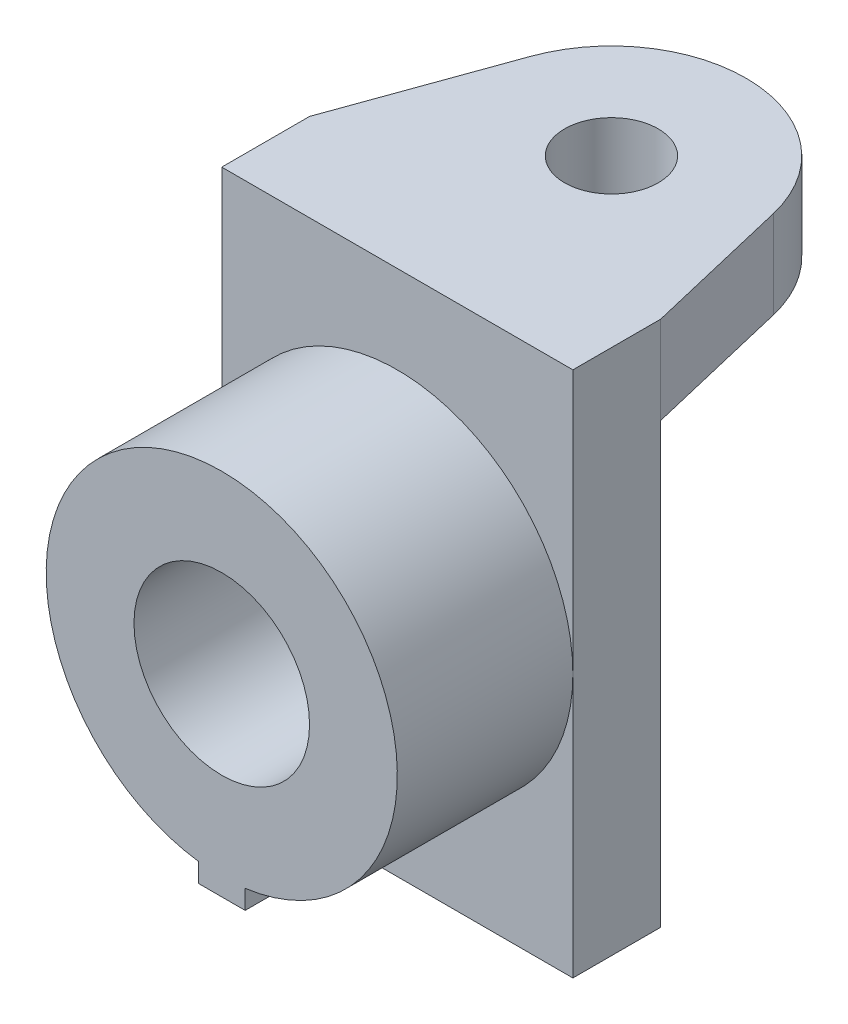
ISO-10303-21;
HEADER;
FILE_DESCRIPTION(('STEP AP214'),'2;1');
FILE_NAME('part.step','',(''),(''),'','','');
FILE_SCHEMA(('AUTOMOTIVE_DESIGN { 1 0 10303 214 1 1 1 1 }'));
ENDSEC;
DATA;
#1=APPLICATION_CONTEXT('core data for automotive mechanical design processes');
#2=APPLICATION_PROTOCOL_DEFINITION('international standard','automotive_design',2000,#1);
#3=PRODUCT_CONTEXT('',#1,'mechanical');
#4=PRODUCT('Part','Part','',(#3));
#5=PRODUCT_RELATED_PRODUCT_CATEGORY('part','',(#4));
#6=PRODUCT_DEFINITION_FORMATION('','',#4);
#7=PRODUCT_DEFINITION_CONTEXT('part definition',#1,'design');
#8=PRODUCT_DEFINITION('design','',#6,#7);
#9=PRODUCT_DEFINITION_SHAPE('','',#8);
#10=(LENGTH_UNIT() NAMED_UNIT(*) SI_UNIT(.MILLI.,.METRE.));
#11=(NAMED_UNIT(*) PLANE_ANGLE_UNIT() SI_UNIT($,.RADIAN.));
#12=(NAMED_UNIT(*) SI_UNIT($,.STERADIAN.) SOLID_ANGLE_UNIT());
#13=UNCERTAINTY_MEASURE_WITH_UNIT(LENGTH_MEASURE(1.E-05),#10,'distance_accuracy_value','');
#14=(GEOMETRIC_REPRESENTATION_CONTEXT(3) GLOBAL_UNCERTAINTY_ASSIGNED_CONTEXT((#13)) GLOBAL_UNIT_ASSIGNED_CONTEXT((#10,
#11,#12)) REPRESENTATION_CONTEXT('',''));
#15=CARTESIAN_POINT('',(0.,0.,0.));
#16=DIRECTION('',(0.,0.,1.));
#17=DIRECTION('',(1.,0.,0.));
#18=AXIS2_PLACEMENT_3D('',#15,#16,#17);
#19=CARTESIAN_POINT('',(0.,0.,0.));
#20=DIRECTION('',(0.,0.,1.));
#21=DIRECTION('',(1.,0.,0.));
#22=AXIS2_PLACEMENT_3D('',#19,#20,#21);
#23=PLANE('',#22);
#24=DIRECTION('',(-1.,0.,0.));
#25=VECTOR('',#24,1.);
#26=CARTESIAN_POINT('',(-7.13576707726763,10.5308398656215,0.));
#27=LINE('',#26,#25);
#28=CARTESIAN_POINT('',(22.8642329227324,10.5308398656215,0.));
#29=VERTEX_POINT('',#28);
#30=CARTESIAN_POINT('',(-37.1357670772676,10.5308398656215,0.));
#31=VERTEX_POINT('',#30);
#32=EDGE_CURVE('E91',#29,#31,#27,.T.);
#33=ORIENTED_EDGE('',*,*,#32,.F.);
#34=DIRECTION('',(0.,1.,0.));
#35=VECTOR('',#34,1.);
#36=CARTESIAN_POINT('',(22.8642329227324,25.5308398656215,0.));
#37=LINE('',#36,#35);
#38=CARTESIAN_POINT('',(22.8642329227324,-64.4691601343785,0.));
#39=VERTEX_POINT('',#38);
#40=EDGE_CURVE('E288',#39,#29,#37,.T.);
#41=ORIENTED_EDGE('',*,*,#40,.F.);
#42=DIRECTION('',(1.,0.,0.));
#43=VECTOR('',#42,1.);
#44=CARTESIAN_POINT('',(-37.1357670772676,-64.4691601343785,0.));
#45=LINE('',#44,#43);
#46=CARTESIAN_POINT('',(-37.1357670772676,-64.4691601343785,0.));
#47=VERTEX_POINT('',#46);
#48=EDGE_CURVE('E285',#47,#39,#45,.T.);
#49=ORIENTED_EDGE('',*,*,#48,.F.);
#50=DIRECTION('',(0.,-1.,0.));
#51=VECTOR('',#50,1.);
#52=CARTESIAN_POINT('',(-37.1357670772676,25.5308398656215,0.));
#53=LINE('',#52,#51);
#54=EDGE_CURVE('E254',#31,#47,#53,.T.);
#55=ORIENTED_EDGE('',*,*,#54,.F.);
#56=EDGE_LOOP('',(#33,#41,#49,#55));
#57=FACE_BOUND('',#56,.T.);
#58=ADVANCED_FACE('F72',(#57),#23,.F.);
#59=CARTESIAN_POINT('',(0.,0.,15.));
#60=DIRECTION('',(0.,0.,1.));
#61=DIRECTION('',(1.,0.,0.));
#62=AXIS2_PLACEMENT_3D('',#59,#60,#61);
#63=PLANE('',#62);
#64=CARTESIAN_POINT('',(-7.13576707726763,-19.4691601343785,15.));
#65=DIRECTION('',(0.,0.,1.));
#66=DIRECTION('',(1.,0.,0.));
#67=AXIS2_PLACEMENT_3D('',#64,#65,#66);
#68=CIRCLE('',#67,30.);
#69=CARTESIAN_POINT('',(-3.13576707726761,-49.2012976290155,15.));
#70=VERTEX_POINT('',#69);
#71=CARTESIAN_POINT('',(22.8642329227324,-19.4691601343785,15.));
#72=VERTEX_POINT('',#71);
#73=EDGE_CURVE('E84',#70,#72,#68,.T.);
#74=ORIENTED_EDGE('',*,*,#73,.F.);
#75=DIRECTION('',(0.,-1.,0.));
#76=VECTOR('',#75,1.);
#77=CARTESIAN_POINT('',(-3.13576707726761,-49.2012976290155,15.));
#78=LINE('',#77,#76);
#79=CARTESIAN_POINT('',(-3.13576707726761,-52.4691601343785,15.));
#80=VERTEX_POINT('',#79);
#81=EDGE_CURVE('E99',#70,#80,#78,.T.);
#82=ORIENTED_EDGE('',*,*,#81,.T.);
#83=DIRECTION('',(1.,0.,0.));
#84=VECTOR('',#83,1.);
#85=CARTESIAN_POINT('',(-11.1357670772676,-52.4691601343785,15.));
#86=LINE('',#85,#84);
#87=CARTESIAN_POINT('',(-11.1357670772676,-52.4691601343785,15.));
#88=VERTEX_POINT('',#87);
#89=EDGE_CURVE('E240',#88,#80,#86,.T.);
#90=ORIENTED_EDGE('',*,*,#89,.F.);
#91=DIRECTION('',(0.,-1.,0.));
#92=VECTOR('',#91,1.);
#93=CARTESIAN_POINT('',(-11.1357670772676,-49.2012976290156,15.));
#94=LINE('',#93,#92);
#95=CARTESIAN_POINT('',(-11.1357670772677,-49.2012976290155,15.));
#96=VERTEX_POINT('',#95);
#97=EDGE_CURVE('E244',#96,#88,#94,.T.);
#98=ORIENTED_EDGE('',*,*,#97,.F.);
#99=CARTESIAN_POINT('',(-37.1357670772676,-19.4691601343785,15.));
#100=VERTEX_POINT('',#99);
#101=EDGE_CURVE('E82',#100,#96,#68,.T.);
#102=ORIENTED_EDGE('',*,*,#101,.F.);
#103=DIRECTION('',(0.,-1.,0.));
#104=VECTOR('',#103,1.);
#105=CARTESIAN_POINT('',(-37.1357670772676,25.5308398656215,15.));
#106=LINE('',#105,#104);
#107=CARTESIAN_POINT('',(-37.1357670772676,-64.4691601343785,15.));
#108=VERTEX_POINT('',#107);
#109=EDGE_CURVE('E270',#100,#108,#106,.T.);
#110=ORIENTED_EDGE('',*,*,#109,.T.);
#111=DIRECTION('',(1.,0.,0.));
#112=VECTOR('',#111,1.);
#113=CARTESIAN_POINT('',(-37.1357670772676,-64.4691601343785,15.));
#114=LINE('',#113,#112);
#115=CARTESIAN_POINT('',(22.8642329227324,-64.4691601343785,15.));
#116=VERTEX_POINT('',#115);
#117=EDGE_CURVE('E269',#108,#116,#114,.T.);
#118=ORIENTED_EDGE('',*,*,#117,.T.);
#119=DIRECTION('',(0.,1.,0.));
#120=VECTOR('',#119,1.);
#121=CARTESIAN_POINT('',(22.8642329227324,25.5308398656215,15.));
#122=LINE('',#121,#120);
#123=EDGE_CURVE('E274',#116,#72,#122,.T.);
#124=ORIENTED_EDGE('',*,*,#123,.T.);
#125=EDGE_LOOP('',(#74,#82,#90,#98,#102,#110,#118,#124));
#126=FACE_BOUND('',#125,.T.);
#127=ADVANCED_FACE('F328',(#126),#63,.T.);
#128=CARTESIAN_POINT('',(-37.1357670772676,25.5308398656215,15.));
#129=DIRECTION('',(1.,0.,0.));
#130=DIRECTION('',(0.,1.,0.));
#131=AXIS2_PLACEMENT_3D('',#128,#129,#130);
#132=PLANE('',#131);
#133=CARTESIAN_POINT('',(-37.1357670772676,25.5308398656215,0.));
#134=VERTEX_POINT('',#133);
#135=EDGE_CURVE('E282',#134,#31,#53,.T.);
#136=ORIENTED_EDGE('',*,*,#135,.T.);
#137=ORIENTED_EDGE('',*,*,#54,.T.);
#138=DIRECTION('',(0.,0.,-1.));
#139=VECTOR('',#138,1.);
#140=CARTESIAN_POINT('',(-37.1357670772676,-64.4691601343785,15.));
#141=LINE('',#140,#139);
#142=EDGE_CURVE('E76',#108,#47,#141,.T.);
#143=ORIENTED_EDGE('',*,*,#142,.F.);
#144=ORIENTED_EDGE('',*,*,#109,.F.);
#145=CARTESIAN_POINT('',(-37.1357670772676,25.5308398656215,15.));
#146=VERTEX_POINT('',#145);
#147=EDGE_CURVE('E265',#146,#100,#106,.T.);
#148=ORIENTED_EDGE('',*,*,#147,.F.);
#149=DIRECTION('',(0.,0.,-1.));
#150=VECTOR('',#149,1.);
#151=CARTESIAN_POINT('',(-37.1357670772676,25.5308398656215,15.));
#152=LINE('',#151,#150);
#153=EDGE_CURVE('E281',#146,#134,#152,.T.);
#154=ORIENTED_EDGE('',*,*,#153,.T.);
#155=EDGE_LOOP('',(#136,#137,#143,#144,#148,#154));
#156=FACE_BOUND('',#155,.T.);
#157=ADVANCED_FACE('F74',(#156),#132,.F.);
#158=CARTESIAN_POINT('',(-37.1357670772676,-64.4691601343785,15.));
#159=DIRECTION('',(0.,1.,0.));
#160=DIRECTION('',(0.,0.,1.));
#161=AXIS2_PLACEMENT_3D('',#158,#159,#160);
#162=PLANE('',#161);
#163=ORIENTED_EDGE('',*,*,#48,.T.);
#164=DIRECTION('',(0.,0.,-1.));
#165=VECTOR('',#164,1.);
#166=CARTESIAN_POINT('',(22.8642329227324,-64.4691601343785,15.));
#167=LINE('',#166,#165);
#168=EDGE_CURVE('E296',#116,#39,#167,.T.);
#169=ORIENTED_EDGE('',*,*,#168,.F.);
#170=ORIENTED_EDGE('',*,*,#117,.F.);
#171=ORIENTED_EDGE('',*,*,#142,.T.);
#172=EDGE_LOOP('',(#163,#169,#170,#171));
#173=FACE_BOUND('',#172,.T.);
#174=ADVANCED_FACE('F337',(#173),#162,.F.);
#175=CARTESIAN_POINT('',(22.8642329227324,25.5308398656215,15.));
#176=DIRECTION('',(-1.,0.,0.));
#177=DIRECTION('',(0.,-1.,0.));
#178=AXIS2_PLACEMENT_3D('',#175,#176,#177);
#179=PLANE('',#178);
#180=ORIENTED_EDGE('',*,*,#40,.T.);
#181=DIRECTION('',(0.,1.,0.));
#182=VECTOR('',#181,1.);
#183=CARTESIAN_POINT('',(22.8642329227324,10.5308398656215,0.));
#184=LINE('',#183,#182);
#185=CARTESIAN_POINT('',(22.8642329227324,25.5308398656215,0.));
#186=VERTEX_POINT('',#185);
#187=EDGE_CURVE('E191',#29,#186,#184,.T.);
#188=ORIENTED_EDGE('',*,*,#187,.T.);
#189=DIRECTION('',(0.,0.,-1.));
#190=VECTOR('',#189,1.);
#191=CARTESIAN_POINT('',(22.8642329227324,25.5308398656215,15.));
#192=LINE('',#191,#190);
#193=CARTESIAN_POINT('',(22.8642329227324,25.5308398656215,15.));
#194=VERTEX_POINT('',#193);
#195=EDGE_CURVE('E293',#194,#186,#192,.T.);
#196=ORIENTED_EDGE('',*,*,#195,.F.);
#197=EDGE_CURVE('E273',#72,#194,#122,.T.);
#198=ORIENTED_EDGE('',*,*,#197,.F.);
#199=ORIENTED_EDGE('',*,*,#123,.F.);
#200=ORIENTED_EDGE('',*,*,#168,.T.);
#201=EDGE_LOOP('',(#180,#188,#196,#198,#199,#200));
#202=FACE_BOUND('',#201,.T.);
#203=ADVANCED_FACE('F352',(#202),#179,.F.);
#204=CARTESIAN_POINT('',(-37.1357670772676,25.5308398656215,15.));
#205=DIRECTION('',(0.,-1.,0.));
#206=DIRECTION('',(0.,0.,-1.));
#207=AXIS2_PLACEMENT_3D('',#204,#205,#206);
#208=PLANE('',#207);
#209=ORIENTED_EDGE('',*,*,#195,.T.);
#210=DIRECTION('',(-0.230824264676834,0.,-0.972995456739855));
#211=VECTOR('',#210,1.);
#212=CARTESIAN_POINT('',(22.8642329227324,25.5308398656215,0.));
#213=LINE('',#212,#211);
#214=CARTESIAN_POINT('',(16.8691395042144,25.5308398656215,-25.2711675140209));
#215=VERTEX_POINT('',#214);
#216=EDGE_CURVE('E206',#186,#215,#213,.T.);
#217=ORIENTED_EDGE('',*,*,#216,.T.);
#218=CARTESIAN_POINT('',(-5.50975600080225,25.5308398656215,-19.9622094264538));
#219=DIRECTION('',(0.,1.,0.));
#220=DIRECTION('',(0.,0.,1.));
#221=AXIS2_PLACEMENT_3D('',#218,#219,#220);
#222=CIRCLE('',#221,23.);
#223=CARTESIAN_POINT('',(-27.1515062685642,25.5308398656215,-27.7490345399276));
#224=VERTEX_POINT('',#223);
#225=EDGE_CURVE('E172',#215,#224,#222,.T.);
#226=ORIENTED_EDGE('',*,*,#225,.T.);
#227=DIRECTION('',(0.338557613629299,0.,-0.940945663815735));
#228=VECTOR('',#227,1.);
#229=CARTESIAN_POINT('',(-37.1357670772676,25.5308398656215,0.));
#230=LINE('',#229,#228);
#231=EDGE_CURVE('E193',#134,#224,#230,.T.);
#232=ORIENTED_EDGE('',*,*,#231,.F.);
#233=ORIENTED_EDGE('',*,*,#153,.F.);
#234=DIRECTION('',(-1.,0.,0.));
#235=VECTOR('',#234,1.);
#236=CARTESIAN_POINT('',(-37.1357670772676,25.5308398656215,15.));
#237=LINE('',#236,#235);
#238=EDGE_CURVE('E278',#194,#146,#237,.T.);
#239=ORIENTED_EDGE('',*,*,#238,.F.);
#240=EDGE_LOOP('',(#209,#217,#226,#232,#233,#239));
#241=FACE_BOUND('',#240,.T.);
#242=CARTESIAN_POINT('',(-5.50975600080225,25.5308398656215,-19.9622094264538));
#243=DIRECTION('',(0.,1.,0.));
#244=DIRECTION('',(0.,0.,1.));
#245=AXIS2_PLACEMENT_3D('',#242,#243,#244);
#246=CIRCLE('',#245,8.);
#247=CARTESIAN_POINT('',(-5.50975600080225,25.5308398656215,-11.9622094264538));
#248=VERTEX_POINT('',#247);
#249=EDGE_CURVE('E199',#248,#248,#246,.T.);
#250=ORIENTED_EDGE('',*,*,#249,.F.);
#251=EDGE_LOOP('',(#250));
#252=FACE_BOUND('',#251,.T.);
#253=ADVANCED_FACE('F345',(#241,#252),#208,.F.);
#254=EDGE_CURVE('E12',#72,#100,#68,.T.);
#255=ORIENTED_EDGE('',*,*,#254,.F.);
#256=ORIENTED_EDGE('',*,*,#197,.T.);
#257=ORIENTED_EDGE('',*,*,#238,.T.);
#258=ORIENTED_EDGE('',*,*,#147,.T.);
#259=EDGE_LOOP('',(#255,#256,#257,#258));
#260=FACE_BOUND('',#259,.T.);
#261=ADVANCED_FACE('F332',(#260),#63,.T.);
#262=CARTESIAN_POINT('',(-7.13576707726763,-19.4691601343785,45.));
#263=DIRECTION('',(0.,0.,1.));
#264=DIRECTION('',(1.,0.,0.));
#265=AXIS2_PLACEMENT_3D('',#262,#263,#264);
#266=PLANE('',#265);
#267=DIRECTION('',(0.,-1.,0.));
#268=VECTOR('',#267,1.);
#269=CARTESIAN_POINT('',(-3.13576707726761,-49.2012976290155,45.));
#270=LINE('',#269,#268);
#271=CARTESIAN_POINT('',(-3.13576707726761,-49.2012976290155,45.));
#272=VERTEX_POINT('',#271);
#273=CARTESIAN_POINT('',(-3.13576707726761,-52.4691601343785,45.));
#274=VERTEX_POINT('',#273);
#275=EDGE_CURVE('E224',#272,#274,#270,.T.);
#276=ORIENTED_EDGE('',*,*,#275,.F.);
#277=CARTESIAN_POINT('',(-7.13576707726763,-19.4691601343785,45.));
#278=DIRECTION('',(0.,0.,1.));
#279=DIRECTION('',(1.,0.,0.));
#280=AXIS2_PLACEMENT_3D('',#277,#278,#279);
#281=CIRCLE('',#280,30.);
#282=CARTESIAN_POINT('',(-11.1357670772677,-49.2012976290155,45.));
#283=VERTEX_POINT('',#282);
#284=EDGE_CURVE('E234',#272,#283,#281,.T.);
#285=ORIENTED_EDGE('',*,*,#284,.T.);
#286=DIRECTION('',(0.,-1.,0.));
#287=VECTOR('',#286,1.);
#288=CARTESIAN_POINT('',(-11.1357670772676,-49.2012976290156,45.));
#289=LINE('',#288,#287);
#290=CARTESIAN_POINT('',(-11.1357670772676,-52.4691601343785,45.));
#291=VERTEX_POINT('',#290);
#292=EDGE_CURVE('E231',#283,#291,#289,.T.);
#293=ORIENTED_EDGE('',*,*,#292,.T.);
#294=DIRECTION('',(1.,0.,0.));
#295=VECTOR('',#294,1.);
#296=CARTESIAN_POINT('',(-11.1357670772676,-52.4691601343785,45.));
#297=LINE('',#296,#295);
#298=EDGE_CURVE('E228',#291,#274,#297,.T.);
#299=ORIENTED_EDGE('',*,*,#298,.T.);
#300=EDGE_LOOP('',(#276,#285,#293,#299));
#301=FACE_BOUND('',#300,.T.);
#302=CARTESIAN_POINT('',(-7.13576707726763,-19.4691601343785,45.));
#303=DIRECTION('',(0.,0.,1.));
#304=DIRECTION('',(1.,0.,0.));
#305=AXIS2_PLACEMENT_3D('',#302,#303,#304);
#306=CIRCLE('',#305,15.);
#307=CARTESIAN_POINT('',(7.86423292273237,-19.4691601343785,45.));
#308=VERTEX_POINT('',#307);
#309=EDGE_CURVE('E217',#308,#308,#306,.T.);
#310=ORIENTED_EDGE('',*,*,#309,.F.);
#311=EDGE_LOOP('',(#310));
#312=FACE_BOUND('',#311,.T.);
#313=ADVANCED_FACE('F321',(#301,#312),#266,.T.);
#314=CARTESIAN_POINT('',(-3.13576707726761,-49.2012976290155,45.));
#315=DIRECTION('',(1.,0.,0.));
#316=DIRECTION('',(0.,1.,0.));
#317=AXIS2_PLACEMENT_3D('',#314,#315,#316);
#318=PLANE('',#317);
#319=ORIENTED_EDGE('',*,*,#81,.F.);
#320=DIRECTION('',(0.,0.,-1.));
#321=VECTOR('',#320,1.);
#322=CARTESIAN_POINT('',(-3.13576707726761,-49.2012976290155,45.));
#323=LINE('',#322,#321);
#324=EDGE_CURVE('E250',#272,#70,#323,.T.);
#325=ORIENTED_EDGE('',*,*,#324,.F.);
#326=ORIENTED_EDGE('',*,*,#275,.T.);
#327=DIRECTION('',(0.,0.,-1.));
#328=VECTOR('',#327,1.);
#329=CARTESIAN_POINT('',(-3.13576707726761,-52.4691601343785,45.));
#330=LINE('',#329,#328);
#331=EDGE_CURVE('E237',#274,#80,#330,.T.);
#332=ORIENTED_EDGE('',*,*,#331,.T.);
#333=EDGE_LOOP('',(#319,#325,#326,#332));
#334=FACE_BOUND('',#333,.T.);
#335=ADVANCED_FACE('F325',(#334),#318,.T.);
#336=CARTESIAN_POINT('',(-7.13576707726763,-19.4691601343785,45.));
#337=DIRECTION('',(0.,0.,-1.));
#338=DIRECTION('',(-1.,0.,0.));
#339=AXIS2_PLACEMENT_3D('',#336,#337,#338);
#340=CYLINDRICAL_SURFACE('',#339,30.);
#341=ORIENTED_EDGE('',*,*,#73,.T.);
#342=ORIENTED_EDGE('',*,*,#254,.T.);
#343=ORIENTED_EDGE('',*,*,#101,.T.);
#344=DIRECTION('',(0.,0.,-1.));
#345=VECTOR('',#344,1.);
#346=CARTESIAN_POINT('',(-11.1357670772677,-49.2012976290155,45.));
#347=LINE('',#346,#345);
#348=EDGE_CURVE('E255',#283,#96,#347,.T.);
#349=ORIENTED_EDGE('',*,*,#348,.F.);
#350=ORIENTED_EDGE('',*,*,#284,.F.);
#351=ORIENTED_EDGE('',*,*,#324,.T.);
#352=EDGE_LOOP('',(#341,#342,#343,#349,#350,#351));
#353=FACE_BOUND('',#352,.T.);
#354=ADVANCED_FACE('F311',(#353),#340,.T.);
#355=CARTESIAN_POINT('',(-11.1357670772676,-49.2012976290156,45.));
#356=DIRECTION('',(1.,0.,0.));
#357=DIRECTION('',(0.,1.,0.));
#358=AXIS2_PLACEMENT_3D('',#355,#356,#357);
#359=PLANE('',#358);
#360=ORIENTED_EDGE('',*,*,#97,.T.);
#361=DIRECTION('',(0.,0.,-1.));
#362=VECTOR('',#361,1.);
#363=CARTESIAN_POINT('',(-11.1357670772676,-52.4691601343785,45.));
#364=LINE('',#363,#362);
#365=EDGE_CURVE('E259',#291,#88,#364,.T.);
#366=ORIENTED_EDGE('',*,*,#365,.F.);
#367=ORIENTED_EDGE('',*,*,#292,.F.);
#368=ORIENTED_EDGE('',*,*,#348,.T.);
#369=EDGE_LOOP('',(#360,#366,#367,#368));
#370=FACE_BOUND('',#369,.T.);
#371=ADVANCED_FACE('F316',(#370),#359,.F.);
#372=CARTESIAN_POINT('',(-11.1357670772676,-52.4691601343785,45.));
#373=DIRECTION('',(0.,1.,0.));
#374=DIRECTION('',(-1.,0.,0.));
#375=AXIS2_PLACEMENT_3D('',#372,#373,#374);
#376=PLANE('',#375);
#377=ORIENTED_EDGE('',*,*,#89,.T.);
#378=ORIENTED_EDGE('',*,*,#331,.F.);
#379=ORIENTED_EDGE('',*,*,#298,.F.);
#380=ORIENTED_EDGE('',*,*,#365,.T.);
#381=EDGE_LOOP('',(#377,#378,#379,#380));
#382=FACE_BOUND('',#381,.T.);
#383=ADVANCED_FACE('F327',(#382),#376,.F.);
#384=CARTESIAN_POINT('',(-7.13576707726763,-19.4691601343785,45.));
#385=DIRECTION('',(0.,0.,-1.));
#386=DIRECTION('',(-1.,0.,0.));
#387=AXIS2_PLACEMENT_3D('',#384,#385,#386);
#388=CYLINDRICAL_SURFACE('',#387,15.);
#389=ORIENTED_EDGE('',*,*,#309,.T.);
#390=EDGE_LOOP('',(#389));
#391=FACE_BOUND('',#390,.T.);
#392=CARTESIAN_POINT('',(-7.13576707726763,-19.4691601343785,15.));
#393=DIRECTION('',(0.,0.,1.));
#394=DIRECTION('',(1.,0.,0.));
#395=AXIS2_PLACEMENT_3D('',#392,#393,#394);
#396=CIRCLE('',#395,15.);
#397=CARTESIAN_POINT('',(7.86423292273237,-19.4691601343785,15.));
#398=VERTEX_POINT('',#397);
#399=EDGE_CURVE('E214',#398,#398,#396,.T.);
#400=ORIENTED_EDGE('',*,*,#399,.F.);
#401=EDGE_LOOP('',(#400));
#402=FACE_BOUND('',#401,.T.);
#403=ADVANCED_FACE('F342',(#391,#402),#388,.F.);
#404=ORIENTED_EDGE('',*,*,#399,.T.);
#405=EDGE_LOOP('',(#404));
#406=FACE_BOUND('',#405,.T.);
#407=ADVANCED_FACE('F331',(#406),#63,.T.);
#408=CARTESIAN_POINT('',(22.8642329227324,10.5308398656215,0.));
#409=DIRECTION('',(0.972995456739855,0.,-0.230824264676834));
#410=DIRECTION('',(-0.230824264676834,0.,-0.972995456739855));
#411=AXIS2_PLACEMENT_3D('',#408,#409,#410);
#412=PLANE('',#411);
#413=ORIENTED_EDGE('',*,*,#216,.F.);
#414=ORIENTED_EDGE('',*,*,#187,.F.);
#415=DIRECTION('',(-0.230824264676834,0.,-0.972995456739855));
#416=VECTOR('',#415,1.);
#417=CARTESIAN_POINT('',(22.8642329227324,10.5308398656215,0.));
#418=LINE('',#417,#416);
#419=CARTESIAN_POINT('',(16.8691395042144,10.5308398656215,-25.2711675140209));
#420=VERTEX_POINT('',#419);
#421=EDGE_CURVE('E183',#29,#420,#418,.T.);
#422=ORIENTED_EDGE('',*,*,#421,.T.);
#423=DIRECTION('',(0.,1.,0.));
#424=VECTOR('',#423,1.);
#425=CARTESIAN_POINT('',(16.8691395042144,10.5308398656215,-25.2711675140209));
#426=LINE('',#425,#424);
#427=EDGE_CURVE('E167',#420,#215,#426,.T.);
#428=ORIENTED_EDGE('',*,*,#427,.T.);
#429=EDGE_LOOP('',(#413,#414,#422,#428));
#430=FACE_BOUND('',#429,.T.);
#431=ADVANCED_FACE('F190',(#430),#412,.T.);
#432=CARTESIAN_POINT('',(-37.1357670772676,10.5308398656215,0.));
#433=DIRECTION('',(0.940945663815735,0.,0.338557613629299));
#434=DIRECTION('',(0.338557613629299,0.,-0.940945663815735));
#435=AXIS2_PLACEMENT_3D('',#432,#433,#434);
#436=PLANE('',#435);
#437=ORIENTED_EDGE('',*,*,#231,.T.);
#438=DIRECTION('',(0.,1.,0.));
#439=VECTOR('',#438,1.);
#440=CARTESIAN_POINT('',(-27.1515062685642,10.5308398656215,-27.7490345399276));
#441=LINE('',#440,#439);
#442=CARTESIAN_POINT('',(-27.1515062685642,10.5308398656215,-27.7490345399276));
#443=VERTEX_POINT('',#442);
#444=EDGE_CURVE('E178',#443,#224,#441,.T.);
#445=ORIENTED_EDGE('',*,*,#444,.F.);
#446=DIRECTION('',(0.338557613629299,0.,-0.940945663815735));
#447=VECTOR('',#446,1.);
#448=CARTESIAN_POINT('',(-37.1357670772676,10.5308398656215,0.));
#449=LINE('',#448,#447);
#450=EDGE_CURVE('E185',#31,#443,#449,.T.);
#451=ORIENTED_EDGE('',*,*,#450,.F.);
#452=ORIENTED_EDGE('',*,*,#135,.F.);
#453=EDGE_LOOP('',(#437,#445,#451,#452));
#454=FACE_BOUND('',#453,.T.);
#455=ADVANCED_FACE('F368',(#454),#436,.F.);
#456=CARTESIAN_POINT('',(-5.50975600080225,10.5308398656215,-19.9622094264538));
#457=DIRECTION('',(0.,1.,0.));
#458=DIRECTION('',(0.,0.,1.));
#459=AXIS2_PLACEMENT_3D('',#456,#457,#458);
#460=CYLINDRICAL_SURFACE('',#459,23.);
#461=ORIENTED_EDGE('',*,*,#225,.F.);
#462=ORIENTED_EDGE('',*,*,#427,.F.);
#463=CARTESIAN_POINT('',(-5.50975600080225,10.5308398656215,-19.9622094264538));
#464=DIRECTION('',(0.,1.,0.));
#465=DIRECTION('',(0.,0.,1.));
#466=AXIS2_PLACEMENT_3D('',#463,#464,#465);
#467=CIRCLE('',#466,23.);
#468=EDGE_CURVE('E170',#420,#443,#467,.T.);
#469=ORIENTED_EDGE('',*,*,#468,.T.);
#470=ORIENTED_EDGE('',*,*,#444,.T.);
#471=EDGE_LOOP('',(#461,#462,#469,#470));
#472=FACE_BOUND('',#471,.T.);
#473=ADVANCED_FACE('F169',(#472),#460,.T.);
#474=CARTESIAN_POINT('',(-5.50975600080225,10.5308398656215,-19.9622094264538));
#475=DIRECTION('',(0.,1.,0.));
#476=DIRECTION('',(0.,0.,1.));
#477=AXIS2_PLACEMENT_3D('',#474,#475,#476);
#478=PLANE('',#477);
#479=CARTESIAN_POINT('',(-5.50975600080225,10.5308398656215,-19.9622094264538));
#480=DIRECTION('',(0.,1.,0.));
#481=DIRECTION('',(0.,0.,1.));
#482=AXIS2_PLACEMENT_3D('',#479,#480,#481);
#483=CIRCLE('',#482,8.);
#484=CARTESIAN_POINT('',(-5.50975600080225,10.5308398656215,-11.9622094264538));
#485=VERTEX_POINT('',#484);
#486=EDGE_CURVE('E209',#485,#485,#483,.T.);
#487=ORIENTED_EDGE('',*,*,#486,.T.);
#488=EDGE_LOOP('',(#487));
#489=FACE_BOUND('',#488,.T.);
#490=ORIENTED_EDGE('',*,*,#421,.F.);
#491=ORIENTED_EDGE('',*,*,#32,.T.);
#492=ORIENTED_EDGE('',*,*,#450,.T.);
#493=ORIENTED_EDGE('',*,*,#468,.F.);
#494=EDGE_LOOP('',(#490,#491,#492,#493));
#495=FACE_BOUND('',#494,.T.);
#496=ADVANCED_FACE('F182',(#489,#495),#478,.F.);
#497=CARTESIAN_POINT('',(-5.50975600080225,10.5308398656215,-19.9622094264538));
#498=DIRECTION('',(0.,1.,0.));
#499=DIRECTION('',(0.,0.,1.));
#500=AXIS2_PLACEMENT_3D('',#497,#498,#499);
#501=CYLINDRICAL_SURFACE('',#500,8.);
#502=ORIENTED_EDGE('',*,*,#486,.F.);
#503=EDGE_LOOP('',(#502));
#504=FACE_BOUND('',#503,.T.);
#505=ORIENTED_EDGE('',*,*,#249,.T.);
#506=EDGE_LOOP('',(#505));
#507=FACE_BOUND('',#506,.T.);
#508=ADVANCED_FACE('F441',(#504,#507),#501,.F.);
#509=CLOSED_SHELL('',(#58,#127,#157,#174,#203,#253,#261,#313,#335,#354,#371,#383,#403,#407,#431,
#455,#473,#496,#508));
#510=MANIFOLD_SOLID_BREP('B2',#509);
#511=ADVANCED_BREP_SHAPE_REPRESENTATION('',(#18,#510),#14);
#512=SHAPE_DEFINITION_REPRESENTATION(#9,#511);
ENDSEC;
END-ISO-10303-21;
